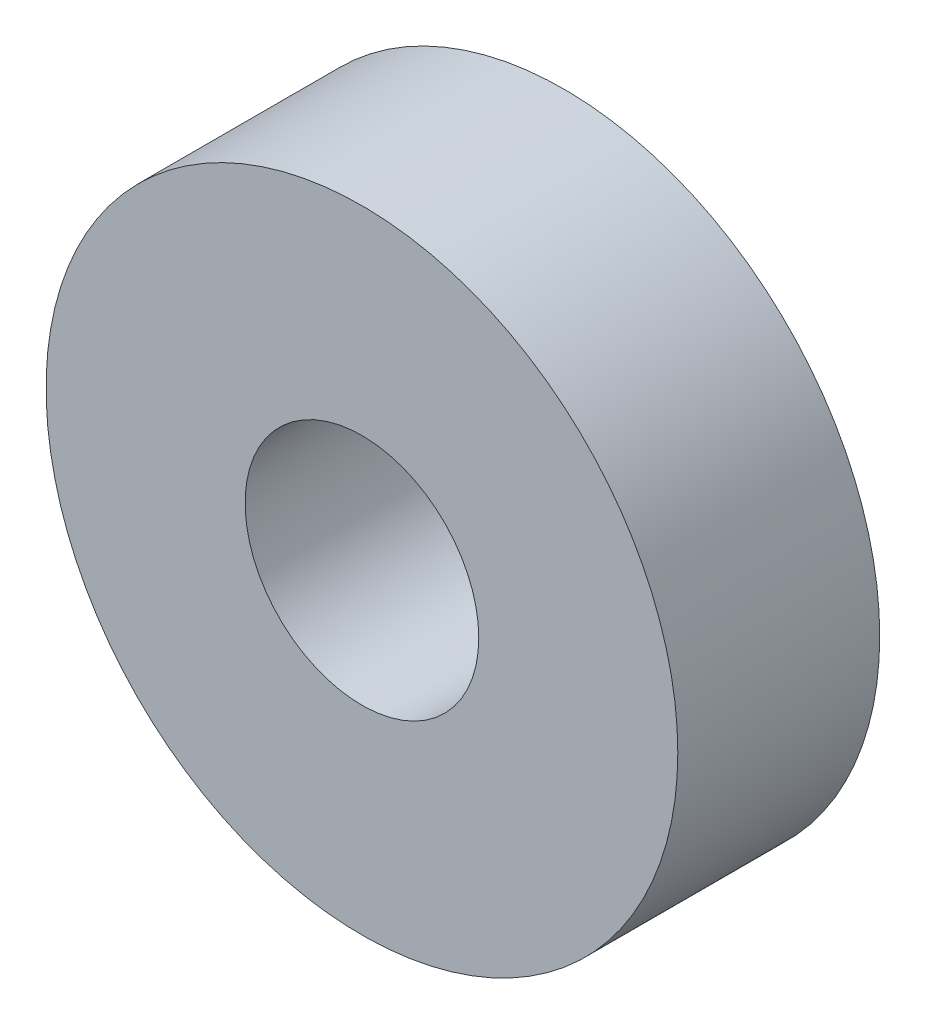
ISO-10303-21;
HEADER;
FILE_DESCRIPTION(('STEP AP214'),'2;1');
FILE_NAME('part.step','',(''),(''),'','','');
FILE_SCHEMA(('AUTOMOTIVE_DESIGN { 1 0 10303 214 1 1 1 1 }'));
ENDSEC;
DATA;
#1=APPLICATION_CONTEXT('core data for automotive mechanical design processes');
#2=APPLICATION_PROTOCOL_DEFINITION('international standard','automotive_design',2000,#1);
#3=PRODUCT_CONTEXT('',#1,'mechanical');
#4=PRODUCT('Part','Part','',(#3));
#5=PRODUCT_RELATED_PRODUCT_CATEGORY('part','',(#4));
#6=PRODUCT_DEFINITION_FORMATION('','',#4);
#7=PRODUCT_DEFINITION_CONTEXT('part definition',#1,'design');
#8=PRODUCT_DEFINITION('design','',#6,#7);
#9=PRODUCT_DEFINITION_SHAPE('','',#8);
#10=(LENGTH_UNIT() NAMED_UNIT(*) SI_UNIT(.MILLI.,.METRE.));
#11=(NAMED_UNIT(*) PLANE_ANGLE_UNIT() SI_UNIT($,.RADIAN.));
#12=(NAMED_UNIT(*) SI_UNIT($,.STERADIAN.) SOLID_ANGLE_UNIT());
#13=UNCERTAINTY_MEASURE_WITH_UNIT(LENGTH_MEASURE(1.E-05),#10,'distance_accuracy_value','');
#14=(GEOMETRIC_REPRESENTATION_CONTEXT(3) GLOBAL_UNCERTAINTY_ASSIGNED_CONTEXT((#13)) GLOBAL_UNIT_ASSIGNED_CONTEXT((#10,
#11,#12)) REPRESENTATION_CONTEXT('',''));
#15=CARTESIAN_POINT('',(0.,0.,0.));
#16=DIRECTION('',(0.,0.,1.));
#17=DIRECTION('',(1.,0.,0.));
#18=AXIS2_PLACEMENT_3D('',#15,#16,#17);
#19=CARTESIAN_POINT('',(0.,0.,7.));
#20=DIRECTION('',(0.,0.,1.));
#21=DIRECTION('',(1.,0.,0.));
#22=AXIS2_PLACEMENT_3D('',#19,#20,#21);
#23=PLANE('',#22);
#24=CARTESIAN_POINT('',(0.,0.,7.));
#25=DIRECTION('',(0.,0.,1.));
#26=DIRECTION('',(1.,0.,0.));
#27=AXIS2_PLACEMENT_3D('',#24,#25,#26);
#28=CIRCLE('',#27,10.95);
#29=CARTESIAN_POINT('',(10.95,0.,7.));
#30=VERTEX_POINT('',#29);
#31=EDGE_CURVE('E10',#30,#30,#28,.T.);
#32=ORIENTED_EDGE('',*,*,#31,.T.);
#33=EDGE_LOOP('',(#32));
#34=FACE_BOUND('',#33,.T.);
#35=CARTESIAN_POINT('',(0.,0.,7.));
#36=DIRECTION('',(0.,0.,1.));
#37=DIRECTION('',(1.,0.,0.));
#38=AXIS2_PLACEMENT_3D('',#35,#36,#37);
#39=CIRCLE('',#38,4.05);
#40=CARTESIAN_POINT('',(4.05,0.,7.));
#41=VERTEX_POINT('',#40);
#42=EDGE_CURVE('E42',#41,#41,#39,.T.);
#43=ORIENTED_EDGE('',*,*,#42,.F.);
#44=EDGE_LOOP('',(#43));
#45=FACE_BOUND('',#44,.T.);
#46=ADVANCED_FACE('F31',(#34,#45),#23,.T.);
#47=CARTESIAN_POINT('',(0.,0.,0.));
#48=DIRECTION('',(0.,0.,1.));
#49=DIRECTION('',(1.,0.,0.));
#50=AXIS2_PLACEMENT_3D('',#47,#48,#49);
#51=PLANE('',#50);
#52=CARTESIAN_POINT('',(0.,0.,0.));
#53=DIRECTION('',(0.,0.,1.));
#54=DIRECTION('',(1.,0.,0.));
#55=AXIS2_PLACEMENT_3D('',#52,#53,#54);
#56=CIRCLE('',#55,10.95);
#57=CARTESIAN_POINT('',(10.95,0.,0.));
#58=VERTEX_POINT('',#57);
#59=EDGE_CURVE('E35',#58,#58,#56,.T.);
#60=ORIENTED_EDGE('',*,*,#59,.F.);
#61=EDGE_LOOP('',(#60));
#62=FACE_BOUND('',#61,.T.);
#63=CARTESIAN_POINT('',(0.,0.,0.));
#64=DIRECTION('',(0.,0.,1.));
#65=DIRECTION('',(1.,0.,0.));
#66=AXIS2_PLACEMENT_3D('',#63,#64,#65);
#67=CIRCLE('',#66,4.05);
#68=CARTESIAN_POINT('',(4.05,0.,0.));
#69=VERTEX_POINT('',#68);
#70=EDGE_CURVE('E44',#69,#69,#67,.T.);
#71=ORIENTED_EDGE('',*,*,#70,.T.);
#72=EDGE_LOOP('',(#71));
#73=FACE_BOUND('',#72,.T.);
#74=ADVANCED_FACE('F54',(#62,#73),#51,.F.);
#75=CARTESIAN_POINT('',(0.,0.,7.));
#76=DIRECTION('',(0.,0.,-1.));
#77=DIRECTION('',(-1.,0.,0.));
#78=AXIS2_PLACEMENT_3D('',#75,#76,#77);
#79=CYLINDRICAL_SURFACE('',#78,10.95);
#80=ORIENTED_EDGE('',*,*,#31,.F.);
#81=EDGE_LOOP('',(#80));
#82=FACE_BOUND('',#81,.T.);
#83=ORIENTED_EDGE('',*,*,#59,.T.);
#84=EDGE_LOOP('',(#83));
#85=FACE_BOUND('',#84,.T.);
#86=ADVANCED_FACE('F33',(#82,#85),#79,.T.);
#87=CARTESIAN_POINT('',(0.,0.,7.));
#88=DIRECTION('',(0.,0.,-1.));
#89=DIRECTION('',(-1.,0.,0.));
#90=AXIS2_PLACEMENT_3D('',#87,#88,#89);
#91=CYLINDRICAL_SURFACE('',#90,4.05);
#92=ORIENTED_EDGE('',*,*,#42,.T.);
#93=EDGE_LOOP('',(#92));
#94=FACE_BOUND('',#93,.T.);
#95=ORIENTED_EDGE('',*,*,#70,.F.);
#96=EDGE_LOOP('',(#95));
#97=FACE_BOUND('',#96,.T.);
#98=ADVANCED_FACE('F50',(#94,#97),#91,.F.);
#99=CLOSED_SHELL('',(#46,#74,#86,#98));
#100=MANIFOLD_SOLID_BREP('B2',#99);
#101=ADVANCED_BREP_SHAPE_REPRESENTATION('',(#18,#100),#14);
#102=SHAPE_DEFINITION_REPRESENTATION(#9,#101);
ENDSEC;
END-ISO-10303-21;
